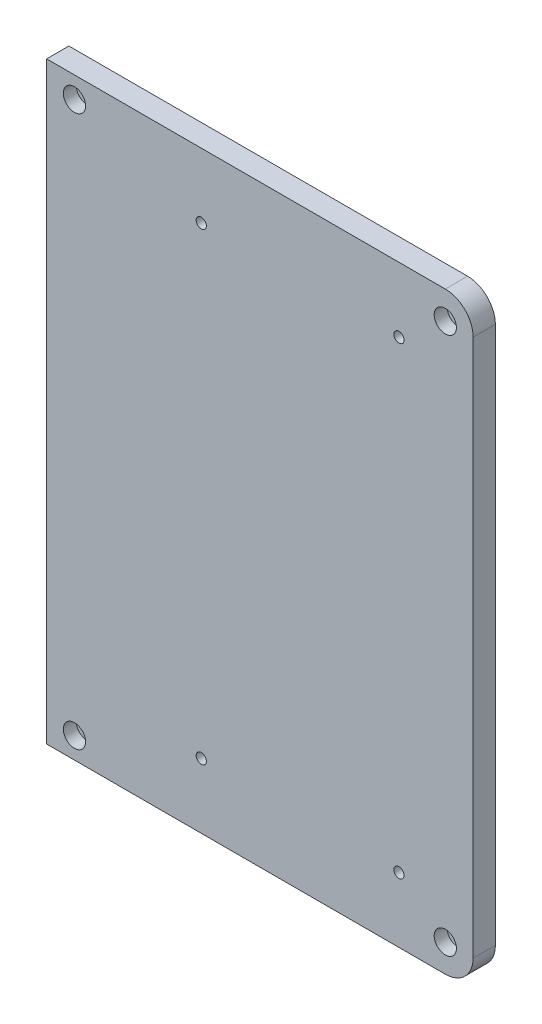
ISO-10303-21;
HEADER;
FILE_DESCRIPTION(('STEP AP214'),'2;1');
FILE_NAME('part.step','',(''),(''),'','','');
FILE_SCHEMA(('AUTOMOTIVE_DESIGN { 1 0 10303 214 1 1 1 1 }'));
ENDSEC;
DATA;
#1=APPLICATION_CONTEXT('core data for automotive mechanical design processes');
#2=APPLICATION_PROTOCOL_DEFINITION('international standard','automotive_design',2000,#1);
#3=PRODUCT_CONTEXT('',#1,'mechanical');
#4=PRODUCT('Part','Part','',(#3));
#5=PRODUCT_RELATED_PRODUCT_CATEGORY('part','',(#4));
#6=PRODUCT_DEFINITION_FORMATION('','',#4);
#7=PRODUCT_DEFINITION_CONTEXT('part definition',#1,'design');
#8=PRODUCT_DEFINITION('design','',#6,#7);
#9=PRODUCT_DEFINITION_SHAPE('','',#8);
#10=(LENGTH_UNIT() NAMED_UNIT(*) SI_UNIT(.MILLI.,.METRE.));
#11=(NAMED_UNIT(*) PLANE_ANGLE_UNIT() SI_UNIT($,.RADIAN.));
#12=(NAMED_UNIT(*) SI_UNIT($,.STERADIAN.) SOLID_ANGLE_UNIT());
#13=UNCERTAINTY_MEASURE_WITH_UNIT(LENGTH_MEASURE(1.E-05),#10,'distance_accuracy_value','');
#14=(GEOMETRIC_REPRESENTATION_CONTEXT(3) GLOBAL_UNCERTAINTY_ASSIGNED_CONTEXT((#13)) GLOBAL_UNIT_ASSIGNED_CONTEXT((#10,
#11,#12)) REPRESENTATION_CONTEXT('',''));
#15=CARTESIAN_POINT('',(0.,0.,0.));
#16=DIRECTION('',(0.,0.,1.));
#17=DIRECTION('',(1.,0.,0.));
#18=AXIS2_PLACEMENT_3D('',#15,#16,#17);
#19=CARTESIAN_POINT('',(7.49999999999997,74.25,-4.94974746830584));
#20=DIRECTION('',(0.,0.,1.));
#21=DIRECTION('',(1.,0.,0.));
#22=AXIS2_PLACEMENT_3D('',#19,#20,#21);
#23=CYLINDRICAL_SURFACE('',#22,1.75);
#24=CARTESIAN_POINT('',(7.49999999999997,74.25,0.));
#25=DIRECTION('',(0.,0.,1.));
#26=DIRECTION('',(1.,0.,0.));
#27=AXIS2_PLACEMENT_3D('',#24,#25,#26);
#28=CIRCLE('',#27,1.75);
#29=CARTESIAN_POINT('',(9.24999999999997,74.25,0.));
#30=VERTEX_POINT('',#29);
#31=EDGE_CURVE('E163',#30,#30,#28,.F.);
#32=ORIENTED_EDGE('',*,*,#31,.T.);
#33=EDGE_LOOP('',(#32));
#34=FACE_BOUND('',#33,.T.);
#35=CARTESIAN_POINT('',(7.49999999999997,74.25,2.5));
#36=DIRECTION('',(0.,0.,1.));
#37=DIRECTION('',(1.,0.,0.));
#38=AXIS2_PLACEMENT_3D('',#35,#36,#37);
#39=CIRCLE('',#38,1.75);
#40=CARTESIAN_POINT('',(9.24999999999997,74.25,2.5));
#41=VERTEX_POINT('',#40);
#42=EDGE_CURVE('E37',#41,#41,#39,.F.);
#43=ORIENTED_EDGE('',*,*,#42,.F.);
#44=EDGE_LOOP('',(#43));
#45=FACE_BOUND('',#44,.T.);
#46=ADVANCED_FACE('F33',(#34,#45),#23,.F.);
#47=CARTESIAN_POINT('',(7.49999999999997,-74.25,-4.94974746830584));
#48=DIRECTION('',(0.,0.,1.));
#49=DIRECTION('',(1.,0.,0.));
#50=AXIS2_PLACEMENT_3D('',#47,#48,#49);
#51=CYLINDRICAL_SURFACE('',#50,1.75);
#52=CARTESIAN_POINT('',(7.49999999999997,-74.25,0.));
#53=DIRECTION('',(0.,0.,1.));
#54=DIRECTION('',(1.,0.,0.));
#55=AXIS2_PLACEMENT_3D('',#52,#53,#54);
#56=CIRCLE('',#55,1.75);
#57=CARTESIAN_POINT('',(9.24999999999997,-74.25,0.));
#58=VERTEX_POINT('',#57);
#59=EDGE_CURVE('E105',#58,#58,#56,.F.);
#60=ORIENTED_EDGE('',*,*,#59,.T.);
#61=EDGE_LOOP('',(#60));
#62=FACE_BOUND('',#61,.T.);
#63=CARTESIAN_POINT('',(7.49999999999997,-74.25,2.5));
#64=DIRECTION('',(0.,0.,1.));
#65=DIRECTION('',(1.,0.,0.));
#66=AXIS2_PLACEMENT_3D('',#63,#64,#65);
#67=CIRCLE('',#66,1.75);
#68=CARTESIAN_POINT('',(9.24999999999997,-74.25,2.5));
#69=VERTEX_POINT('',#68);
#70=EDGE_CURVE('E150',#69,#69,#67,.F.);
#71=ORIENTED_EDGE('',*,*,#70,.F.);
#72=EDGE_LOOP('',(#71));
#73=FACE_BOUND('',#72,.T.);
#74=ADVANCED_FACE('F225',(#62,#73),#51,.F.);
#75=CARTESIAN_POINT('',(107.5,72.5,-4.));
#76=DIRECTION('',(0.,0.,1.));
#77=DIRECTION('',(1.,0.,0.));
#78=AXIS2_PLACEMENT_3D('',#75,#76,#77);
#79=CYLINDRICAL_SURFACE('',#78,1.75);
#80=CARTESIAN_POINT('',(107.5,72.5,0.));
#81=DIRECTION('',(0.,0.,1.));
#82=DIRECTION('',(1.,0.,0.));
#83=AXIS2_PLACEMENT_3D('',#80,#81,#82);
#84=CIRCLE('',#83,1.75);
#85=CARTESIAN_POINT('',(109.25,72.5,0.));
#86=VERTEX_POINT('',#85);
#87=EDGE_CURVE('E139',#86,#86,#84,.T.);
#88=ORIENTED_EDGE('',*,*,#87,.F.);
#89=EDGE_LOOP('',(#88));
#90=FACE_BOUND('',#89,.T.);
#91=CARTESIAN_POINT('',(107.5,72.5,2.5));
#92=DIRECTION('',(0.,0.,1.));
#93=DIRECTION('',(1.,0.,0.));
#94=AXIS2_PLACEMENT_3D('',#91,#92,#93);
#95=CIRCLE('',#94,1.75);
#96=CARTESIAN_POINT('',(109.25,72.5,2.5));
#97=VERTEX_POINT('',#96);
#98=EDGE_CURVE('E142',#97,#97,#95,.F.);
#99=ORIENTED_EDGE('',*,*,#98,.F.);
#100=EDGE_LOOP('',(#99));
#101=FACE_BOUND('',#100,.T.);
#102=ADVANCED_FACE('F231',(#90,#101),#79,.F.);
#103=CARTESIAN_POINT('',(107.5,-72.5,-4.));
#104=DIRECTION('',(0.,0.,1.));
#105=DIRECTION('',(1.,0.,0.));
#106=AXIS2_PLACEMENT_3D('',#103,#104,#105);
#107=CYLINDRICAL_SURFACE('',#106,1.75);
#108=CARTESIAN_POINT('',(107.5,-72.5,0.));
#109=DIRECTION('',(0.,0.,1.));
#110=DIRECTION('',(1.,0.,0.));
#111=AXIS2_PLACEMENT_3D('',#108,#109,#110);
#112=CIRCLE('',#111,1.75);
#113=CARTESIAN_POINT('',(109.25,-72.5,0.));
#114=VERTEX_POINT('',#113);
#115=EDGE_CURVE('E127',#114,#114,#112,.T.);
#116=ORIENTED_EDGE('',*,*,#115,.F.);
#117=EDGE_LOOP('',(#116));
#118=FACE_BOUND('',#117,.T.);
#119=CARTESIAN_POINT('',(107.5,-72.5,2.5));
#120=DIRECTION('',(0.,0.,1.));
#121=DIRECTION('',(1.,0.,0.));
#122=AXIS2_PLACEMENT_3D('',#119,#120,#121);
#123=CIRCLE('',#122,1.75);
#124=CARTESIAN_POINT('',(109.25,-72.5,2.5));
#125=VERTEX_POINT('',#124);
#126=EDGE_CURVE('E145',#125,#125,#123,.F.);
#127=ORIENTED_EDGE('',*,*,#126,.F.);
#128=EDGE_LOOP('',(#127));
#129=FACE_BOUND('',#128,.T.);
#130=ADVANCED_FACE('F279',(#118,#129),#107,.F.);
#131=CARTESIAN_POINT('',(-107.5,-80.,6.));
#132=DIRECTION('',(0.,1.,0.));
#133=DIRECTION('',(0.,0.,1.));
#134=AXIS2_PLACEMENT_3D('',#131,#132,#133);
#135=PLANE('',#134);
#136=DIRECTION('',(1.,0.,0.));
#137=VECTOR('',#136,1.);
#138=CARTESIAN_POINT('',(-107.5,-80.,6.));
#139=LINE('',#138,#137);
#140=CARTESIAN_POINT('',(0.,-80.,6.));
#141=VERTEX_POINT('',#140);
#142=CARTESIAN_POINT('',(107.5,-80.,6.));
#143=VERTEX_POINT('',#142);
#144=EDGE_CURVE('E86',#141,#143,#139,.T.);
#145=ORIENTED_EDGE('',*,*,#144,.F.);
#146=DIRECTION('',(0.,0.,1.));
#147=VECTOR('',#146,1.);
#148=CARTESIAN_POINT('',(0.,-80.,-4.));
#149=LINE('',#148,#147);
#150=CARTESIAN_POINT('',(0.,-80.,0.));
#151=VERTEX_POINT('',#150);
#152=EDGE_CURVE('E95',#151,#141,#149,.T.);
#153=ORIENTED_EDGE('',*,*,#152,.F.);
#154=DIRECTION('',(1.,0.,0.));
#155=VECTOR('',#154,1.);
#156=CARTESIAN_POINT('',(-107.5,-80.,0.));
#157=LINE('',#156,#155);
#158=CARTESIAN_POINT('',(107.5,-80.,0.));
#159=VERTEX_POINT('',#158);
#160=EDGE_CURVE('E124',#151,#159,#157,.T.);
#161=ORIENTED_EDGE('',*,*,#160,.T.);
#162=DIRECTION('',(0.,0.,-1.));
#163=VECTOR('',#162,1.);
#164=CARTESIAN_POINT('',(107.5,-80.,6.));
#165=LINE('',#164,#163);
#166=EDGE_CURVE('E42',#143,#159,#165,.T.);
#167=ORIENTED_EDGE('',*,*,#166,.F.);
#168=EDGE_LOOP('',(#145,#153,#161,#167));
#169=FACE_BOUND('',#168,.T.);
#170=ADVANCED_FACE('F35',(#169),#135,.F.);
#171=CARTESIAN_POINT('',(107.5,-72.5,6.));
#172=DIRECTION('',(0.,0.,-1.));
#173=DIRECTION('',(-1.,0.,0.));
#174=AXIS2_PLACEMENT_3D('',#171,#172,#173);
#175=CYLINDRICAL_SURFACE('',#174,7.5);
#176=CARTESIAN_POINT('',(107.5,-72.5,0.));
#177=DIRECTION('',(0.,0.,1.));
#178=DIRECTION('',(1.,0.,0.));
#179=AXIS2_PLACEMENT_3D('',#176,#177,#178);
#180=CIRCLE('',#179,7.5);
#181=CARTESIAN_POINT('',(115.,-72.5,0.));
#182=VERTEX_POINT('',#181);
#183=EDGE_CURVE('E126',#159,#182,#180,.T.);
#184=ORIENTED_EDGE('',*,*,#183,.T.);
#185=DIRECTION('',(0.,0.,-1.));
#186=VECTOR('',#185,1.);
#187=CARTESIAN_POINT('',(115.,-72.5,6.));
#188=LINE('',#187,#186);
#189=CARTESIAN_POINT('',(115.,-72.5,6.));
#190=VERTEX_POINT('',#189);
#191=EDGE_CURVE('E135',#190,#182,#188,.T.);
#192=ORIENTED_EDGE('',*,*,#191,.F.);
#193=CARTESIAN_POINT('',(107.5,-72.5,6.));
#194=DIRECTION('',(0.,0.,1.));
#195=DIRECTION('',(1.,0.,0.));
#196=AXIS2_PLACEMENT_3D('',#193,#194,#195);
#197=CIRCLE('',#196,7.5);
#198=EDGE_CURVE('E109',#143,#190,#197,.T.);
#199=ORIENTED_EDGE('',*,*,#198,.F.);
#200=ORIENTED_EDGE('',*,*,#166,.T.);
#201=EDGE_LOOP('',(#184,#192,#199,#200));
#202=FACE_BOUND('',#201,.T.);
#203=ADVANCED_FACE('F296',(#202),#175,.T.);
#204=CARTESIAN_POINT('',(115.,72.5,6.));
#205=DIRECTION('',(-1.,0.,0.));
#206=DIRECTION('',(0.,-1.,0.));
#207=AXIS2_PLACEMENT_3D('',#204,#205,#206);
#208=PLANE('',#207);
#209=DIRECTION('',(0.,1.,0.));
#210=VECTOR('',#209,1.);
#211=CARTESIAN_POINT('',(115.,72.5,0.));
#212=LINE('',#211,#210);
#213=CARTESIAN_POINT('',(115.,72.5,0.));
#214=VERTEX_POINT('',#213);
#215=EDGE_CURVE('E129',#182,#214,#212,.T.);
#216=ORIENTED_EDGE('',*,*,#215,.T.);
#217=DIRECTION('',(0.,0.,-1.));
#218=VECTOR('',#217,1.);
#219=CARTESIAN_POINT('',(115.,72.5,6.));
#220=LINE('',#219,#218);
#221=CARTESIAN_POINT('',(115.,72.5,6.));
#222=VERTEX_POINT('',#221);
#223=EDGE_CURVE('E133',#222,#214,#220,.T.);
#224=ORIENTED_EDGE('',*,*,#223,.F.);
#225=DIRECTION('',(0.,1.,0.));
#226=VECTOR('',#225,1.);
#227=CARTESIAN_POINT('',(115.,72.5,6.));
#228=LINE('',#227,#226);
#229=EDGE_CURVE('E112',#190,#222,#228,.T.);
#230=ORIENTED_EDGE('',*,*,#229,.F.);
#231=ORIENTED_EDGE('',*,*,#191,.T.);
#232=EDGE_LOOP('',(#216,#224,#230,#231));
#233=FACE_BOUND('',#232,.T.);
#234=ADVANCED_FACE('F301',(#233),#208,.F.);
#235=CARTESIAN_POINT('',(107.5,72.5,6.));
#236=DIRECTION('',(0.,0.,-1.));
#237=DIRECTION('',(-1.,0.,0.));
#238=AXIS2_PLACEMENT_3D('',#235,#236,#237);
#239=CYLINDRICAL_SURFACE('',#238,7.49999999999999);
#240=CARTESIAN_POINT('',(107.5,72.5,0.));
#241=DIRECTION('',(0.,0.,1.));
#242=DIRECTION('',(-1.,0.,0.));
#243=AXIS2_PLACEMENT_3D('',#240,#241,#242);
#244=CIRCLE('',#243,7.49999999999999);
#245=CARTESIAN_POINT('',(107.5,80.,0.));
#246=VERTEX_POINT('',#245);
#247=EDGE_CURVE('E79',#214,#246,#244,.T.);
#248=ORIENTED_EDGE('',*,*,#247,.T.);
#249=DIRECTION('',(0.,0.,-1.));
#250=VECTOR('',#249,1.);
#251=CARTESIAN_POINT('',(107.5,80.,6.));
#252=LINE('',#251,#250);
#253=CARTESIAN_POINT('',(107.5,80.,6.));
#254=VERTEX_POINT('',#253);
#255=EDGE_CURVE('E123',#254,#246,#252,.T.);
#256=ORIENTED_EDGE('',*,*,#255,.F.);
#257=CARTESIAN_POINT('',(107.5,72.5,6.));
#258=DIRECTION('',(0.,0.,1.));
#259=DIRECTION('',(-1.,0.,0.));
#260=AXIS2_PLACEMENT_3D('',#257,#258,#259);
#261=CIRCLE('',#260,7.49999999999999);
#262=EDGE_CURVE('E58',#222,#254,#261,.T.);
#263=ORIENTED_EDGE('',*,*,#262,.F.);
#264=ORIENTED_EDGE('',*,*,#223,.T.);
#265=EDGE_LOOP('',(#248,#256,#263,#264));
#266=FACE_BOUND('',#265,.T.);
#267=ADVANCED_FACE('F218',(#266),#239,.T.);
#268=CARTESIAN_POINT('',(-107.5,80.,6.));
#269=DIRECTION('',(0.,-1.,0.));
#270=DIRECTION('',(0.,0.,-1.));
#271=AXIS2_PLACEMENT_3D('',#268,#269,#270);
#272=PLANE('',#271);
#273=DIRECTION('',(-1.,0.,0.));
#274=VECTOR('',#273,1.);
#275=CARTESIAN_POINT('',(-107.5,80.,0.));
#276=LINE('',#275,#274);
#277=CARTESIAN_POINT('',(0.,80.,0.));
#278=VERTEX_POINT('',#277);
#279=EDGE_CURVE('E110',#246,#278,#276,.T.);
#280=ORIENTED_EDGE('',*,*,#279,.T.);
#281=DIRECTION('',(0.,0.,1.));
#282=VECTOR('',#281,1.);
#283=CARTESIAN_POINT('',(0.,80.,-4.));
#284=LINE('',#283,#282);
#285=CARTESIAN_POINT('',(0.,80.,6.));
#286=VERTEX_POINT('',#285);
#287=EDGE_CURVE('E50',#278,#286,#284,.T.);
#288=ORIENTED_EDGE('',*,*,#287,.T.);
#289=DIRECTION('',(-1.,0.,0.));
#290=VECTOR('',#289,1.);
#291=CARTESIAN_POINT('',(-107.5,80.,6.));
#292=LINE('',#291,#290);
#293=EDGE_CURVE('E104',#254,#286,#292,.T.);
#294=ORIENTED_EDGE('',*,*,#293,.F.);
#295=ORIENTED_EDGE('',*,*,#255,.T.);
#296=EDGE_LOOP('',(#280,#288,#294,#295));
#297=FACE_BOUND('',#296,.T.);
#298=ADVANCED_FACE('F208',(#297),#272,.F.);
#299=CARTESIAN_POINT('',(-107.5,-72.5,6.));
#300=DIRECTION('',(0.,0.,1.));
#301=DIRECTION('',(1.,0.,0.));
#302=AXIS2_PLACEMENT_3D('',#299,#300,#301);
#303=PLANE('',#302);
#304=CARTESIAN_POINT('',(7.49999999999997,74.25,6.));
#305=DIRECTION('',(0.,0.,1.));
#306=DIRECTION('',(1.,0.,0.));
#307=AXIS2_PLACEMENT_3D('',#304,#305,#306);
#308=CIRCLE('',#307,3.);
#309=CARTESIAN_POINT('',(10.5,74.25,6.));
#310=VERTEX_POINT('',#309);
#311=EDGE_CURVE('E453',#310,#310,#308,.T.);
#312=ORIENTED_EDGE('',*,*,#311,.F.);
#313=EDGE_LOOP('',(#312));
#314=FACE_BOUND('',#313,.T.);
#315=CARTESIAN_POINT('',(7.49999999999997,-74.25,6.));
#316=DIRECTION('',(0.,0.,1.));
#317=DIRECTION('',(1.,0.,0.));
#318=AXIS2_PLACEMENT_3D('',#315,#316,#317);
#319=CIRCLE('',#318,3.);
#320=CARTESIAN_POINT('',(10.5,-74.25,6.));
#321=VERTEX_POINT('',#320);
#322=EDGE_CURVE('E158',#321,#321,#319,.T.);
#323=ORIENTED_EDGE('',*,*,#322,.F.);
#324=EDGE_LOOP('',(#323));
#325=FACE_BOUND('',#324,.T.);
#326=DIRECTION('',(0.,1.,0.));
#327=VECTOR('',#326,1.);
#328=CARTESIAN_POINT('',(0.,80.,6.));
#329=LINE('',#328,#327);
#330=EDGE_CURVE('E97',#141,#286,#329,.T.);
#331=ORIENTED_EDGE('',*,*,#330,.F.);
#332=ORIENTED_EDGE('',*,*,#144,.T.);
#333=ORIENTED_EDGE('',*,*,#198,.T.);
#334=ORIENTED_EDGE('',*,*,#229,.T.);
#335=ORIENTED_EDGE('',*,*,#262,.T.);
#336=ORIENTED_EDGE('',*,*,#293,.T.);
#337=EDGE_LOOP('',(#331,#332,#333,#334,#335,#336));
#338=FACE_BOUND('',#337,.T.);
#339=CARTESIAN_POINT('',(95.,62.5,6.));
#340=DIRECTION('',(0.,0.,1.));
#341=DIRECTION('',(1.,0.,0.));
#342=AXIS2_PLACEMENT_3D('',#339,#340,#341);
#343=CIRCLE('',#342,1.375);
#344=CARTESIAN_POINT('',(96.375,62.5,6.));
#345=VERTEX_POINT('',#344);
#346=EDGE_CURVE('E184',#345,#345,#343,.T.);
#347=ORIENTED_EDGE('',*,*,#346,.F.);
#348=EDGE_LOOP('',(#347));
#349=FACE_BOUND('',#348,.T.);
#350=CARTESIAN_POINT('',(41.7,-62.5,6.));
#351=DIRECTION('',(0.,0.,1.));
#352=DIRECTION('',(1.,0.,0.));
#353=AXIS2_PLACEMENT_3D('',#350,#351,#352);
#354=CIRCLE('',#353,1.375);
#355=CARTESIAN_POINT('',(43.075,-62.5,6.));
#356=VERTEX_POINT('',#355);
#357=EDGE_CURVE('E181',#356,#356,#354,.T.);
#358=ORIENTED_EDGE('',*,*,#357,.F.);
#359=EDGE_LOOP('',(#358));
#360=FACE_BOUND('',#359,.T.);
#361=CARTESIAN_POINT('',(41.7,62.5,6.));
#362=DIRECTION('',(0.,0.,1.));
#363=DIRECTION('',(1.,0.,0.));
#364=AXIS2_PLACEMENT_3D('',#361,#362,#363);
#365=CIRCLE('',#364,1.375);
#366=CARTESIAN_POINT('',(43.075,62.5,6.));
#367=VERTEX_POINT('',#366);
#368=EDGE_CURVE('E173',#367,#367,#365,.T.);
#369=ORIENTED_EDGE('',*,*,#368,.F.);
#370=EDGE_LOOP('',(#369));
#371=FACE_BOUND('',#370,.T.);
#372=CARTESIAN_POINT('',(95.,-62.5,6.));
#373=DIRECTION('',(0.,0.,1.));
#374=DIRECTION('',(1.,0.,0.));
#375=AXIS2_PLACEMENT_3D('',#372,#373,#374);
#376=CIRCLE('',#375,1.375);
#377=CARTESIAN_POINT('',(96.375,-62.5,6.));
#378=VERTEX_POINT('',#377);
#379=EDGE_CURVE('E190',#378,#378,#376,.T.);
#380=ORIENTED_EDGE('',*,*,#379,.F.);
#381=EDGE_LOOP('',(#380));
#382=FACE_BOUND('',#381,.T.);
#383=CARTESIAN_POINT('',(107.5,72.5,6.));
#384=DIRECTION('',(0.,0.,1.));
#385=DIRECTION('',(1.,0.,0.));
#386=AXIS2_PLACEMENT_3D('',#383,#384,#385);
#387=CIRCLE('',#386,3.00000000000001);
#388=CARTESIAN_POINT('',(110.5,72.5,6.));
#389=VERTEX_POINT('',#388);
#390=EDGE_CURVE('E195',#389,#389,#387,.T.);
#391=ORIENTED_EDGE('',*,*,#390,.F.);
#392=EDGE_LOOP('',(#391));
#393=FACE_BOUND('',#392,.T.);
#394=CARTESIAN_POINT('',(107.5,-72.5,6.));
#395=DIRECTION('',(0.,0.,1.));
#396=DIRECTION('',(1.,0.,0.));
#397=AXIS2_PLACEMENT_3D('',#394,#395,#396);
#398=CIRCLE('',#397,3.00000000000001);
#399=CARTESIAN_POINT('',(110.5,-72.5,6.));
#400=VERTEX_POINT('',#399);
#401=EDGE_CURVE('E117',#400,#400,#398,.T.);
#402=ORIENTED_EDGE('',*,*,#401,.F.);
#403=EDGE_LOOP('',(#402));
#404=FACE_BOUND('',#403,.T.);
#405=ADVANCED_FACE('F101',(#314,#325,#338,#349,#360,#371,#382,#393,#404),#303,.T.);
#406=CARTESIAN_POINT('',(-107.5,-72.5,0.));
#407=DIRECTION('',(0.,0.,1.));
#408=DIRECTION('',(1.,0.,0.));
#409=AXIS2_PLACEMENT_3D('',#406,#407,#408);
#410=PLANE('',#409);
#411=ORIENTED_EDGE('',*,*,#31,.F.);
#412=EDGE_LOOP('',(#411));
#413=FACE_BOUND('',#412,.T.);
#414=ORIENTED_EDGE('',*,*,#59,.F.);
#415=EDGE_LOOP('',(#414));
#416=FACE_BOUND('',#415,.T.);
#417=CARTESIAN_POINT('',(95.,62.5,0.));
#418=DIRECTION('',(0.,0.,1.));
#419=DIRECTION('',(1.,0.,0.));
#420=AXIS2_PLACEMENT_3D('',#417,#418,#419);
#421=CIRCLE('',#420,1.375);
#422=CARTESIAN_POINT('',(96.375,62.5,0.));
#423=VERTEX_POINT('',#422);
#424=EDGE_CURVE('E170',#423,#423,#421,.T.);
#425=ORIENTED_EDGE('',*,*,#424,.T.);
#426=EDGE_LOOP('',(#425));
#427=FACE_BOUND('',#426,.T.);
#428=CARTESIAN_POINT('',(41.7,-62.5,0.));
#429=DIRECTION('',(0.,0.,1.));
#430=DIRECTION('',(1.,0.,0.));
#431=AXIS2_PLACEMENT_3D('',#428,#429,#430);
#432=CIRCLE('',#431,1.375);
#433=CARTESIAN_POINT('',(43.075,-62.5,0.));
#434=VERTEX_POINT('',#433);
#435=EDGE_CURVE('E174',#434,#434,#432,.T.);
#436=ORIENTED_EDGE('',*,*,#435,.T.);
#437=EDGE_LOOP('',(#436));
#438=FACE_BOUND('',#437,.T.);
#439=CARTESIAN_POINT('',(41.7,62.5,0.));
#440=DIRECTION('',(0.,0.,1.));
#441=DIRECTION('',(1.,0.,0.));
#442=AXIS2_PLACEMENT_3D('',#439,#440,#441);
#443=CIRCLE('',#442,1.375);
#444=CARTESIAN_POINT('',(43.075,62.5,0.));
#445=VERTEX_POINT('',#444);
#446=EDGE_CURVE('E168',#445,#445,#443,.T.);
#447=ORIENTED_EDGE('',*,*,#446,.T.);
#448=EDGE_LOOP('',(#447));
#449=FACE_BOUND('',#448,.T.);
#450=CARTESIAN_POINT('',(95.,-62.5,0.));
#451=DIRECTION('',(0.,0.,1.));
#452=DIRECTION('',(1.,0.,0.));
#453=AXIS2_PLACEMENT_3D('',#450,#451,#452);
#454=CIRCLE('',#453,1.375);
#455=CARTESIAN_POINT('',(96.375,-62.5,0.));
#456=VERTEX_POINT('',#455);
#457=EDGE_CURVE('E187',#456,#456,#454,.T.);
#458=ORIENTED_EDGE('',*,*,#457,.T.);
#459=EDGE_LOOP('',(#458));
#460=FACE_BOUND('',#459,.T.);
#461=ORIENTED_EDGE('',*,*,#115,.T.);
#462=EDGE_LOOP('',(#461));
#463=FACE_BOUND('',#462,.T.);
#464=ORIENTED_EDGE('',*,*,#87,.T.);
#465=EDGE_LOOP('',(#464));
#466=FACE_BOUND('',#465,.T.);
#467=ORIENTED_EDGE('',*,*,#160,.F.);
#468=DIRECTION('',(0.,1.,0.));
#469=VECTOR('',#468,1.);
#470=CARTESIAN_POINT('',(0.,-72.5,0.));
#471=LINE('',#470,#469);
#472=EDGE_CURVE('E11',#151,#278,#471,.T.);
#473=ORIENTED_EDGE('',*,*,#472,.T.);
#474=ORIENTED_EDGE('',*,*,#279,.F.);
#475=ORIENTED_EDGE('',*,*,#247,.F.);
#476=ORIENTED_EDGE('',*,*,#215,.F.);
#477=ORIENTED_EDGE('',*,*,#183,.F.);
#478=EDGE_LOOP('',(#467,#473,#474,#475,#476,#477));
#479=FACE_BOUND('',#478,.T.);
#480=ADVANCED_FACE('F207',(#413,#416,#427,#438,#449,#460,#463,#466,#479),#410,.F.);
#481=CARTESIAN_POINT('',(107.5,-72.5,2.5));
#482=DIRECTION('',(0.,0.,1.));
#483=DIRECTION('',(1.,0.,0.));
#484=AXIS2_PLACEMENT_3D('',#481,#482,#483);
#485=PLANE('',#484);
#486=CARTESIAN_POINT('',(107.5,-72.5,2.5));
#487=DIRECTION('',(0.,0.,1.));
#488=DIRECTION('',(1.,0.,0.));
#489=AXIS2_PLACEMENT_3D('',#486,#487,#488);
#490=CIRCLE('',#489,3.00000000000001);
#491=CARTESIAN_POINT('',(110.5,-72.5,2.5));
#492=VERTEX_POINT('',#491);
#493=EDGE_CURVE('E197',#492,#492,#490,.T.);
#494=ORIENTED_EDGE('',*,*,#493,.T.);
#495=EDGE_LOOP('',(#494));
#496=FACE_BOUND('',#495,.T.);
#497=ORIENTED_EDGE('',*,*,#126,.T.);
#498=EDGE_LOOP('',(#497));
#499=FACE_BOUND('',#498,.T.);
#500=ADVANCED_FACE('F215',(#496,#499),#485,.T.);
#501=CARTESIAN_POINT('',(107.5,-72.5,2.5));
#502=DIRECTION('',(0.,0.,1.));
#503=DIRECTION('',(1.,0.,0.));
#504=AXIS2_PLACEMENT_3D('',#501,#502,#503);
#505=CYLINDRICAL_SURFACE('',#504,3.00000000000001);
#506=ORIENTED_EDGE('',*,*,#493,.F.);
#507=EDGE_LOOP('',(#506));
#508=FACE_BOUND('',#507,.T.);
#509=ORIENTED_EDGE('',*,*,#401,.T.);
#510=EDGE_LOOP('',(#509));
#511=FACE_BOUND('',#510,.T.);
#512=ADVANCED_FACE('F204',(#508,#511),#505,.F.);
#513=CARTESIAN_POINT('',(107.5,72.5,2.5));
#514=DIRECTION('',(0.,0.,1.));
#515=DIRECTION('',(1.,0.,0.));
#516=AXIS2_PLACEMENT_3D('',#513,#514,#515);
#517=PLANE('',#516);
#518=CARTESIAN_POINT('',(107.5,72.5,2.5));
#519=DIRECTION('',(0.,0.,1.));
#520=DIRECTION('',(1.,0.,0.));
#521=AXIS2_PLACEMENT_3D('',#518,#519,#520);
#522=CIRCLE('',#521,3.00000000000001);
#523=CARTESIAN_POINT('',(110.5,72.5,2.5));
#524=VERTEX_POINT('',#523);
#525=EDGE_CURVE('E148',#524,#524,#522,.T.);
#526=ORIENTED_EDGE('',*,*,#525,.T.);
#527=EDGE_LOOP('',(#526));
#528=FACE_BOUND('',#527,.T.);
#529=ORIENTED_EDGE('',*,*,#98,.T.);
#530=EDGE_LOOP('',(#529));
#531=FACE_BOUND('',#530,.T.);
#532=ADVANCED_FACE('F267',(#528,#531),#517,.T.);
#533=CARTESIAN_POINT('',(107.5,72.5,2.5));
#534=DIRECTION('',(0.,0.,1.));
#535=DIRECTION('',(1.,0.,0.));
#536=AXIS2_PLACEMENT_3D('',#533,#534,#535);
#537=CYLINDRICAL_SURFACE('',#536,3.00000000000001);
#538=ORIENTED_EDGE('',*,*,#525,.F.);
#539=EDGE_LOOP('',(#538));
#540=FACE_BOUND('',#539,.T.);
#541=ORIENTED_EDGE('',*,*,#390,.T.);
#542=EDGE_LOOP('',(#541));
#543=FACE_BOUND('',#542,.T.);
#544=ADVANCED_FACE('F265',(#540,#543),#537,.F.);
#545=CARTESIAN_POINT('',(95.,-62.5,0.));
#546=DIRECTION('',(0.,0.,1.));
#547=DIRECTION('',(1.,0.,0.));
#548=AXIS2_PLACEMENT_3D('',#545,#546,#547);
#549=CYLINDRICAL_SURFACE('',#548,1.375);
#550=ORIENTED_EDGE('',*,*,#379,.T.);
#551=EDGE_LOOP('',(#550));
#552=FACE_BOUND('',#551,.T.);
#553=ORIENTED_EDGE('',*,*,#457,.F.);
#554=EDGE_LOOP('',(#553));
#555=FACE_BOUND('',#554,.T.);
#556=ADVANCED_FACE('F261',(#552,#555),#549,.F.);
#557=CARTESIAN_POINT('',(41.7,62.5,0.));
#558=DIRECTION('',(0.,0.,1.));
#559=DIRECTION('',(1.,0.,0.));
#560=AXIS2_PLACEMENT_3D('',#557,#558,#559);
#561=CYLINDRICAL_SURFACE('',#560,1.375);
#562=ORIENTED_EDGE('',*,*,#368,.T.);
#563=EDGE_LOOP('',(#562));
#564=FACE_BOUND('',#563,.T.);
#565=ORIENTED_EDGE('',*,*,#446,.F.);
#566=EDGE_LOOP('',(#565));
#567=FACE_BOUND('',#566,.T.);
#568=ADVANCED_FACE('F257',(#564,#567),#561,.F.);
#569=CARTESIAN_POINT('',(41.7,-62.5,0.));
#570=DIRECTION('',(0.,0.,1.));
#571=DIRECTION('',(1.,0.,0.));
#572=AXIS2_PLACEMENT_3D('',#569,#570,#571);
#573=CYLINDRICAL_SURFACE('',#572,1.375);
#574=ORIENTED_EDGE('',*,*,#357,.T.);
#575=EDGE_LOOP('',(#574));
#576=FACE_BOUND('',#575,.T.);
#577=ORIENTED_EDGE('',*,*,#435,.F.);
#578=EDGE_LOOP('',(#577));
#579=FACE_BOUND('',#578,.T.);
#580=ADVANCED_FACE('F253',(#576,#579),#573,.F.);
#581=CARTESIAN_POINT('',(95.,62.5,0.));
#582=DIRECTION('',(0.,0.,1.));
#583=DIRECTION('',(1.,0.,0.));
#584=AXIS2_PLACEMENT_3D('',#581,#582,#583);
#585=CYLINDRICAL_SURFACE('',#584,1.375);
#586=ORIENTED_EDGE('',*,*,#346,.T.);
#587=EDGE_LOOP('',(#586));
#588=FACE_BOUND('',#587,.T.);
#589=ORIENTED_EDGE('',*,*,#424,.F.);
#590=EDGE_LOOP('',(#589));
#591=FACE_BOUND('',#590,.T.);
#592=ADVANCED_FACE('F250',(#588,#591),#585,.F.);
#593=CARTESIAN_POINT('',(0.,80.,-4.));
#594=DIRECTION('',(1.,0.,0.));
#595=DIRECTION('',(0.,1.,0.));
#596=AXIS2_PLACEMENT_3D('',#593,#594,#595);
#597=PLANE('',#596);
#598=ORIENTED_EDGE('',*,*,#152,.T.);
#599=ORIENTED_EDGE('',*,*,#330,.T.);
#600=ORIENTED_EDGE('',*,*,#287,.F.);
#601=ORIENTED_EDGE('',*,*,#472,.F.);
#602=EDGE_LOOP('',(#598,#599,#600,#601));
#603=FACE_BOUND('',#602,.T.);
#604=ADVANCED_FACE('F96',(#603),#597,.F.);
#605=CARTESIAN_POINT('',(7.49999999999997,-74.25,2.5));
#606=DIRECTION('',(0.,0.,1.));
#607=DIRECTION('',(1.,0.,0.));
#608=AXIS2_PLACEMENT_3D('',#605,#606,#607);
#609=PLANE('',#608);
#610=CARTESIAN_POINT('',(7.49999999999997,-74.25,2.5));
#611=DIRECTION('',(0.,0.,1.));
#612=DIRECTION('',(1.,0.,0.));
#613=AXIS2_PLACEMENT_3D('',#610,#611,#612);
#614=CIRCLE('',#613,3.);
#615=CARTESIAN_POINT('',(10.5,-74.25,2.5));
#616=VERTEX_POINT('',#615);
#617=EDGE_CURVE('E152',#616,#616,#614,.T.);
#618=ORIENTED_EDGE('',*,*,#617,.T.);
#619=EDGE_LOOP('',(#618));
#620=FACE_BOUND('',#619,.T.);
#621=ORIENTED_EDGE('',*,*,#70,.T.);
#622=EDGE_LOOP('',(#621));
#623=FACE_BOUND('',#622,.T.);
#624=ADVANCED_FACE('F240',(#620,#623),#609,.T.);
#625=CARTESIAN_POINT('',(7.49999999999997,-74.25,2.5));
#626=DIRECTION('',(0.,0.,1.));
#627=DIRECTION('',(1.,0.,0.));
#628=AXIS2_PLACEMENT_3D('',#625,#626,#627);
#629=CYLINDRICAL_SURFACE('',#628,3.);
#630=ORIENTED_EDGE('',*,*,#617,.F.);
#631=EDGE_LOOP('',(#630));
#632=FACE_BOUND('',#631,.T.);
#633=ORIENTED_EDGE('',*,*,#322,.T.);
#634=EDGE_LOOP('',(#633));
#635=FACE_BOUND('',#634,.T.);
#636=ADVANCED_FACE('F243',(#632,#635),#629,.F.);
#637=CARTESIAN_POINT('',(7.49999999999997,74.25,2.5));
#638=DIRECTION('',(0.,0.,1.));
#639=DIRECTION('',(1.,0.,0.));
#640=AXIS2_PLACEMENT_3D('',#637,#638,#639);
#641=PLANE('',#640);
#642=CARTESIAN_POINT('',(7.49999999999997,74.25,2.5));
#643=DIRECTION('',(0.,0.,1.));
#644=DIRECTION('',(1.,0.,0.));
#645=AXIS2_PLACEMENT_3D('',#642,#643,#644);
#646=CIRCLE('',#645,3.);
#647=CARTESIAN_POINT('',(10.5,74.25,2.5));
#648=VERTEX_POINT('',#647);
#649=EDGE_CURVE('E451',#648,#648,#646,.T.);
#650=ORIENTED_EDGE('',*,*,#649,.T.);
#651=EDGE_LOOP('',(#650));
#652=FACE_BOUND('',#651,.T.);
#653=ORIENTED_EDGE('',*,*,#42,.T.);
#654=EDGE_LOOP('',(#653));
#655=FACE_BOUND('',#654,.T.);
#656=ADVANCED_FACE('F245',(#652,#655),#641,.T.);
#657=CARTESIAN_POINT('',(7.49999999999997,74.25,2.5));
#658=DIRECTION('',(0.,0.,1.));
#659=DIRECTION('',(1.,0.,0.));
#660=AXIS2_PLACEMENT_3D('',#657,#658,#659);
#661=CYLINDRICAL_SURFACE('',#660,3.);
#662=ORIENTED_EDGE('',*,*,#649,.F.);
#663=EDGE_LOOP('',(#662));
#664=FACE_BOUND('',#663,.T.);
#665=ORIENTED_EDGE('',*,*,#311,.T.);
#666=EDGE_LOOP('',(#665));
#667=FACE_BOUND('',#666,.T.);
#668=ADVANCED_FACE('F238',(#664,#667),#661,.F.);
#669=CLOSED_SHELL('',(#46,#74,#102,#130,#170,#203,#234,#267,#298,#405,#480,#500,#512,#532,#544,
#556,#568,#580,#592,#604,#624,#636,#656,#668));
#670=MANIFOLD_SOLID_BREP('B2',#669);
#671=ADVANCED_BREP_SHAPE_REPRESENTATION('',(#18,#670),#14);
#672=SHAPE_DEFINITION_REPRESENTATION(#9,#671);
ENDSEC;
END-ISO-10303-21;
